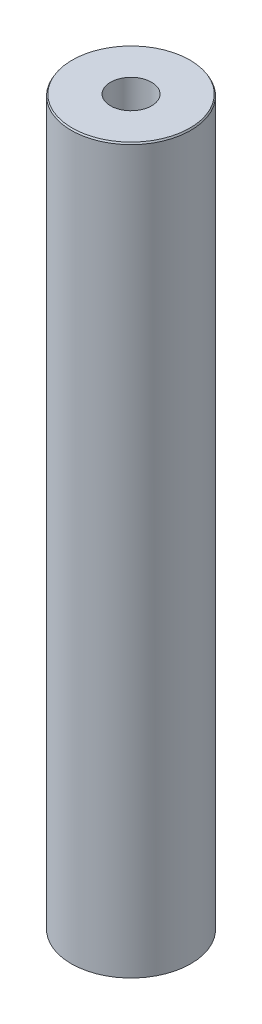
ISO-10303-21;
HEADER;
FILE_DESCRIPTION(('STEP AP214'),'2;1');
FILE_NAME('part.step','',(''),(''),'','','');
FILE_SCHEMA(('AUTOMOTIVE_DESIGN { 1 0 10303 214 1 1 1 1 }'));
ENDSEC;
DATA;
#1=APPLICATION_CONTEXT('core data for automotive mechanical design processes');
#2=APPLICATION_PROTOCOL_DEFINITION('international standard','automotive_design',2000,#1);
#3=PRODUCT_CONTEXT('',#1,'mechanical');
#4=PRODUCT('Part','Part','',(#3));
#5=PRODUCT_RELATED_PRODUCT_CATEGORY('part','',(#4));
#6=PRODUCT_DEFINITION_FORMATION('','',#4);
#7=PRODUCT_DEFINITION_CONTEXT('part definition',#1,'design');
#8=PRODUCT_DEFINITION('design','',#6,#7);
#9=PRODUCT_DEFINITION_SHAPE('','',#8);
#10=(LENGTH_UNIT() NAMED_UNIT(*) SI_UNIT(.MILLI.,.METRE.));
#11=(NAMED_UNIT(*) PLANE_ANGLE_UNIT() SI_UNIT($,.RADIAN.));
#12=(NAMED_UNIT(*) SI_UNIT($,.STERADIAN.) SOLID_ANGLE_UNIT());
#13=UNCERTAINTY_MEASURE_WITH_UNIT(LENGTH_MEASURE(1.E-05),#10,'distance_accuracy_value','');
#14=(GEOMETRIC_REPRESENTATION_CONTEXT(3) GLOBAL_UNCERTAINTY_ASSIGNED_CONTEXT((#13)) GLOBAL_UNIT_ASSIGNED_CONTEXT((#10,
#11,#12)) REPRESENTATION_CONTEXT('',''));
#15=CARTESIAN_POINT('',(0.,0.,0.));
#16=DIRECTION('',(0.,0.,1.));
#17=DIRECTION('',(1.,0.,0.));
#18=AXIS2_PLACEMENT_3D('',#15,#16,#17);
#19=CARTESIAN_POINT('',(0.,393.607728412618,0.));
#20=DIRECTION('',(0.,-1.,0.));
#21=DIRECTION('',(0.,0.,-1.));
#22=AXIS2_PLACEMENT_3D('',#19,#20,#21);
#23=CYLINDRICAL_SURFACE('',#22,32.5);
#24=CARTESIAN_POINT('',(0.,392.7512695448,0.));
#25=DIRECTION('',(0.,1.,0.));
#26=DIRECTION('',(0.,0.,1.));
#27=AXIS2_PLACEMENT_3D('',#24,#25,#26);
#28=CIRCLE('',#27,32.5);
#29=CARTESIAN_POINT('',(0.,392.7512695448,-32.5));
#30=VERTEX_POINT('',#29);
#31=EDGE_CURVE('E50',#30,#30,#28,.F.);
#32=ORIENTED_EDGE('',*,*,#31,.T.);
#33=EDGE_LOOP('',(#32));
#34=FACE_BOUND('',#33,.T.);
#35=CARTESIAN_POINT('',(0.,0.494476757884665,0.));
#36=DIRECTION('',(0.,1.,0.));
#37=DIRECTION('',(0.,0.,1.));
#38=AXIS2_PLACEMENT_3D('',#35,#36,#37);
#39=CIRCLE('',#38,32.5);
#40=CARTESIAN_POINT('',(0.,0.494476757884665,32.5));
#41=VERTEX_POINT('',#40);
#42=EDGE_CURVE('E51',#41,#41,#39,.T.);
#43=ORIENTED_EDGE('',*,*,#42,.T.);
#44=EDGE_LOOP('',(#43));
#45=FACE_BOUND('',#44,.T.);
#46=ADVANCED_FACE('F39',(#34,#45),#23,.T.);
#47=CARTESIAN_POINT('',(0.,393.607728412618,0.));
#48=DIRECTION('',(0.,1.,0.));
#49=DIRECTION('',(0.,0.,1.));
#50=AXIS2_PLACEMENT_3D('',#47,#48,#49);
#51=PLANE('',#50);
#52=CARTESIAN_POINT('',(0.,393.607728412618,0.));
#53=DIRECTION('',(0.,1.,0.));
#54=DIRECTION('',(0.,0.,1.));
#55=AXIS2_PLACEMENT_3D('',#52,#53,#54);
#56=CIRCLE('',#55,32.0055232421154);
#57=CARTESIAN_POINT('',(0.,393.607728412618,-32.0055232421154));
#58=VERTEX_POINT('',#57);
#59=EDGE_CURVE('E54',#58,#58,#56,.T.);
#60=ORIENTED_EDGE('',*,*,#59,.T.);
#61=EDGE_LOOP('',(#60));
#62=FACE_BOUND('',#61,.T.);
#63=CARTESIAN_POINT('',(0.,393.607728412618,0.));
#64=DIRECTION('',(0.,1.,0.));
#65=DIRECTION('',(0.,0.,1.));
#66=AXIS2_PLACEMENT_3D('',#63,#64,#65);
#67=CIRCLE('',#66,11.1476916582724);
#68=CARTESIAN_POINT('',(0.,393.607728412618,11.1476916582724));
#69=VERTEX_POINT('',#68);
#70=EDGE_CURVE('E58',#69,#69,#67,.T.);
#71=ORIENTED_EDGE('',*,*,#70,.F.);
#72=EDGE_LOOP('',(#71));
#73=FACE_BOUND('',#72,.T.);
#74=ADVANCED_FACE('F69',(#62,#73),#51,.T.);
#75=CARTESIAN_POINT('',(0.,0.,0.));
#76=DIRECTION('',(0.,1.,0.));
#77=DIRECTION('',(0.,0.,1.));
#78=AXIS2_PLACEMENT_3D('',#75,#76,#77);
#79=PLANE('',#78);
#80=CARTESIAN_POINT('',(0.,0.,0.));
#81=DIRECTION('',(0.,1.,0.));
#82=DIRECTION('',(0.,0.,1.));
#83=AXIS2_PLACEMENT_3D('',#80,#81,#82);
#84=CIRCLE('',#83,31.6435411321818);
#85=CARTESIAN_POINT('',(0.,0.,31.6435411321818));
#86=VERTEX_POINT('',#85);
#87=EDGE_CURVE('E10',#86,#86,#84,.F.);
#88=ORIENTED_EDGE('',*,*,#87,.T.);
#89=EDGE_LOOP('',(#88));
#90=FACE_BOUND('',#89,.T.);
#91=CARTESIAN_POINT('',(0.,0.,0.));
#92=DIRECTION('',(0.,1.,0.));
#93=DIRECTION('',(0.,0.,1.));
#94=AXIS2_PLACEMENT_3D('',#91,#92,#93);
#95=CIRCLE('',#94,11.1476916582724);
#96=CARTESIAN_POINT('',(0.,0.,11.1476916582724));
#97=VERTEX_POINT('',#96);
#98=EDGE_CURVE('E63',#97,#97,#95,.T.);
#99=ORIENTED_EDGE('',*,*,#98,.T.);
#100=EDGE_LOOP('',(#99));
#101=FACE_BOUND('',#100,.T.);
#102=ADVANCED_FACE('F75',(#90,#101),#79,.F.);
#103=CARTESIAN_POINT('',(0.,393.607728412618,0.));
#104=DIRECTION('',(0.,-1.,0.));
#105=DIRECTION('',(0.,0.,-1.));
#106=AXIS2_PLACEMENT_3D('',#103,#104,#105);
#107=CYLINDRICAL_SURFACE('',#106,11.1476916582724);
#108=ORIENTED_EDGE('',*,*,#70,.T.);
#109=EDGE_LOOP('',(#108));
#110=FACE_BOUND('',#109,.T.);
#111=ORIENTED_EDGE('',*,*,#98,.F.);
#112=EDGE_LOOP('',(#111));
#113=FACE_BOUND('',#112,.T.);
#114=ADVANCED_FACE('F70',(#110,#113),#107,.F.);
#115=CARTESIAN_POINT('',(0.,393.607728412618,0.));
#116=DIRECTION('',(0.,-1.,0.));
#117=DIRECTION('',(0.,0.,-1.));
#118=AXIS2_PLACEMENT_3D('',#115,#116,#117);
#119=CONICAL_SURFACE('',#118,32.0055232421154,0.523598775598316);
#120=CARTESIAN_POINT('',(0.,392.7512695448,-32.5));
#121=CARTESIAN_POINT('',(0.,392.760190991339,-32.4948492004387));
#122=CARTESIAN_POINT('',(0.,392.769112437879,-32.4896984008774));
#123=CARTESIAN_POINT('',(0.,392.786955330959,-32.4793968017548));
#124=CARTESIAN_POINT('',(0.,392.795876777499,-32.4742460021935));
#125=CARTESIAN_POINT('',(0.,392.813719670578,-32.4639444030709));
#126=CARTESIAN_POINT('',(0.,392.822641117118,-32.4587936035096));
#127=CARTESIAN_POINT('',(0.,392.840484010197,-32.448492004387));
#128=CARTESIAN_POINT('',(0.,392.849405456737,-32.4433412048257));
#129=CARTESIAN_POINT('',(0.,392.867248349817,-32.4330396057031));
#130=CARTESIAN_POINT('',(0.,392.876169796356,-32.4278888061419));
#131=CARTESIAN_POINT('',(0.,392.894012689436,-32.4175872070193));
#132=CARTESIAN_POINT('',(0.,392.902934135976,-32.4124364074579));
#133=CARTESIAN_POINT('',(0.,392.920777029055,-32.4021348083353));
#134=CARTESIAN_POINT('',(0.,392.929698475595,-32.3969840087741));
#135=CARTESIAN_POINT('',(0.,392.947541368675,-32.3866824096515));
#136=CARTESIAN_POINT('',(0.,392.956462815214,-32.3815316100902));
#137=CARTESIAN_POINT('',(0.,392.974305708294,-32.3712300109676));
#138=CARTESIAN_POINT('',(0.,392.983227154834,-32.3660792114063));
#139=CARTESIAN_POINT('',(0.,393.001070047913,-32.3557776122837));
#140=CARTESIAN_POINT('',(0.,393.009991494453,-32.3506268127224));
#141=CARTESIAN_POINT('',(0.,393.027834387533,-32.3403252135998));
#142=CARTESIAN_POINT('',(0.,393.036755834072,-32.3351744140385));
#143=CARTESIAN_POINT('',(0.,393.054598727152,-32.3248728149159));
#144=CARTESIAN_POINT('',(0.,393.063520173692,-32.3197220153546));
#145=CARTESIAN_POINT('',(0.,393.081363066771,-32.309420416232));
#146=CARTESIAN_POINT('',(0.,393.090284513311,-32.3042696166707));
#147=CARTESIAN_POINT('',(0.,393.108127406391,-32.2939680175481));
#148=CARTESIAN_POINT('',(0.,393.11704885293,-32.2888172179868));
#149=CARTESIAN_POINT('',(0.,393.13489174601,-32.2785156188642));
#150=CARTESIAN_POINT('',(0.,393.14381319255,-32.2733648193029));
#151=CARTESIAN_POINT('',(0.,393.161656085629,-32.2630632201803));
#152=CARTESIAN_POINT('',(0.,393.170577532169,-32.257912420619));
#153=CARTESIAN_POINT('',(0.,393.188420425248,-32.2476108214964));
#154=CARTESIAN_POINT('',(0.,393.197341871788,-32.2424600219351));
#155=CARTESIAN_POINT('',(0.,393.215184764868,-32.2321584228125));
#156=CARTESIAN_POINT('',(0.,393.224106211408,-32.2270076232512));
#157=CARTESIAN_POINT('',(0.,393.241949104487,-32.2167060241286));
#158=CARTESIAN_POINT('',(0.,393.250870551027,-32.2115552245673));
#159=CARTESIAN_POINT('',(0.,393.268713444106,-32.2012536254447));
#160=CARTESIAN_POINT('',(0.,393.277634890646,-32.1961028258834));
#161=CARTESIAN_POINT('',(0.,393.295477783726,-32.1858012267608));
#162=CARTESIAN_POINT('',(0.,393.304399230265,-32.1806504271995));
#163=CARTESIAN_POINT('',(0.,393.322242123345,-32.1703488280769));
#164=CARTESIAN_POINT('',(0.,393.331163569885,-32.1651980285156));
#165=CARTESIAN_POINT('',(0.,393.349006462964,-32.154896429393));
#166=CARTESIAN_POINT('',(0.,393.357927909504,-32.1497456298318));
#167=CARTESIAN_POINT('',(0.,393.375770802584,-32.1394440307092));
#168=CARTESIAN_POINT('',(0.,393.384692249123,-32.1342932311479));
#169=CARTESIAN_POINT('',(0.,393.402535142203,-32.1239916320253));
#170=CARTESIAN_POINT('',(0.,393.411456588743,-32.118840832464));
#171=CARTESIAN_POINT('',(0.,393.429299481822,-32.1085392333414));
#172=CARTESIAN_POINT('',(0.,393.438220928362,-32.1033884337801));
#173=CARTESIAN_POINT('',(0.,393.456063821442,-32.0930868346575));
#174=CARTESIAN_POINT('',(0.,393.464985267981,-32.0879360350962));
#175=CARTESIAN_POINT('',(0.,393.482828161061,-32.0776344359736));
#176=CARTESIAN_POINT('',(0.,393.491749607601,-32.0724836364123));
#177=CARTESIAN_POINT('',(0.,393.50959250068,-32.0621820372897));
#178=CARTESIAN_POINT('',(0.,393.51851394722,-32.0570312377284));
#179=CARTESIAN_POINT('',(0.,393.5363568403,-32.0467296386058));
#180=CARTESIAN_POINT('',(0.,393.545278286839,-32.0415788390445));
#181=CARTESIAN_POINT('',(0.,393.563121179919,-32.0312772399219));
#182=CARTESIAN_POINT('',(0.,393.572042626459,-32.0261264403606));
#183=CARTESIAN_POINT('',(0.,393.589885519538,-32.015824841238));
#184=CARTESIAN_POINT('',(0.,393.598806966078,-32.0106740416767));
#185=CARTESIAN_POINT('',(0.,393.607728412618,-32.0055232421154));
#186=B_SPLINE_CURVE_WITH_KNOTS('',3,(#120,#121,#122,#123,#124,#125,#126,#127,#128,#129,#130,
#131,#132,#133,#134,#135,#136,#137,#138,#139,#140,#141,#142,#143,#144,#145,#146,#147,#148,#149,
#150,#151,#152,#153,#154,#155,#156,#157,#158,#159,#160,#161,#162,#163,#164,#165,#166,#167,#168,
#169,#170,#171,#172,#173,#174,#175,#176,#177,#178,#179,#180,#181,#182,#183,#184,#185),
.UNSPECIFIED.,.F.,.F.,(4,2,2,2,2,2,2,2,2,2,2,2,2,2,2,2,2,2,2,2,2,2,2,2,2,2,2,2,2,2,2,2,4),(0.,
0.0309047973678125,0.0618095947355804,0.0927143921033929,0.123619189471161,0.154523986838973,
0.185428784206741,0.216333581574554,0.247238378942321,0.278143176310086,0.309047973677902,
0.339952771045666,0.370857568413482,0.401762365781247,0.432667163149063,0.463571960516827,
0.494476757884595,0.525381555252407,0.556286352620175,0.587191149987988,0.618095947355756,
0.649000744723568,0.679905542091336,0.710810339459149,0.741715136826916,0.772619934194681,
0.803524731562497,0.834429528930261,0.865334326298077,0.896239123665841,0.927143921033657,
0.958048718401422,0.988953515769238),.UNSPECIFIED.);
#187=EDGE_CURVE('BSEAM81',#30,#58,#186,.T.);
#188=ORIENTED_EDGE('',*,*,#31,.F.);
#189=ORIENTED_EDGE('',*,*,#59,.F.);
#190=ORIENTED_EDGE('',*,*,#187,.T.);
#191=ORIENTED_EDGE('',*,*,#187,.F.);
#192=EDGE_LOOP('',(#188,#190,#189,#191));
#193=FACE_BOUND('',#192,.T.);
#194=ADVANCED_FACE('F81',(#193),#119,.T.);
#195=CARTESIAN_POINT('',(0.,0.494476757884665,0.));
#196=DIRECTION('',(0.,1.,0.));
#197=DIRECTION('',(0.,0.,1.));
#198=AXIS2_PLACEMENT_3D('',#195,#196,#197);
#199=CONICAL_SURFACE('',#198,32.5,1.0471975511966);
#200=ORIENTED_EDGE('',*,*,#87,.F.);
#201=EDGE_LOOP('',(#200));
#202=FACE_BOUND('',#201,.T.);
#203=ORIENTED_EDGE('',*,*,#42,.F.);
#204=EDGE_LOOP('',(#203));
#205=FACE_BOUND('',#204,.T.);
#206=ADVANCED_FACE('F45',(#202,#205),#199,.T.);
#207=CLOSED_SHELL('',(#46,#74,#102,#114,#194,#206));
#208=MANIFOLD_SOLID_BREP('B2',#207);
#209=ADVANCED_BREP_SHAPE_REPRESENTATION('',(#18,#208),#14);
#210=SHAPE_DEFINITION_REPRESENTATION(#9,#209);
ENDSEC;
END-ISO-10303-21;
